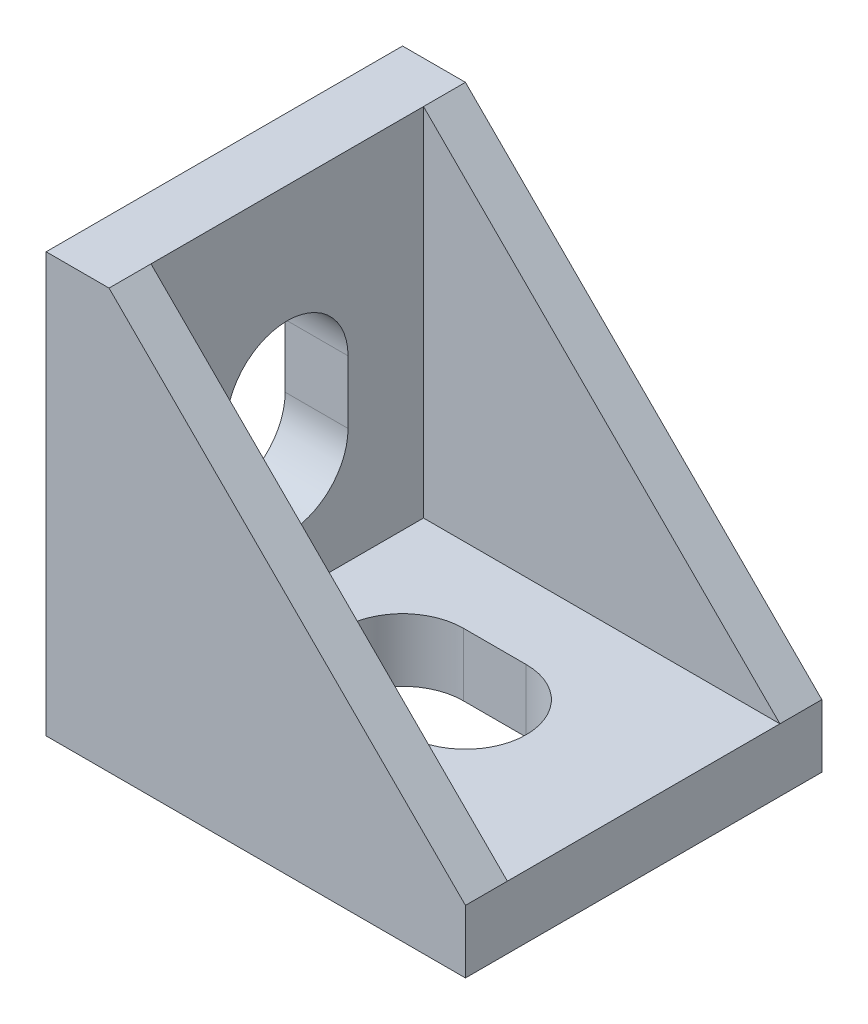
ISO-10303-21;
HEADER;
FILE_DESCRIPTION(('STEP AP214'),'2;1');
FILE_NAME('part.step','',(''),(''),'','','');
FILE_SCHEMA(('AUTOMOTIVE_DESIGN { 1 0 10303 214 1 1 1 1 }'));
ENDSEC;
DATA;
#1=APPLICATION_CONTEXT('core data for automotive mechanical design processes');
#2=APPLICATION_PROTOCOL_DEFINITION('international standard','automotive_design',2000,#1);
#3=PRODUCT_CONTEXT('',#1,'mechanical');
#4=PRODUCT('Part','Part','',(#3));
#5=PRODUCT_RELATED_PRODUCT_CATEGORY('part','',(#4));
#6=PRODUCT_DEFINITION_FORMATION('','',#4);
#7=PRODUCT_DEFINITION_CONTEXT('part definition',#1,'design');
#8=PRODUCT_DEFINITION('design','',#6,#7);
#9=PRODUCT_DEFINITION_SHAPE('','',#8);
#10=(LENGTH_UNIT() NAMED_UNIT(*) SI_UNIT(.MILLI.,.METRE.));
#11=(NAMED_UNIT(*) PLANE_ANGLE_UNIT() SI_UNIT($,.RADIAN.));
#12=(NAMED_UNIT(*) SI_UNIT($,.STERADIAN.) SOLID_ANGLE_UNIT());
#13=UNCERTAINTY_MEASURE_WITH_UNIT(LENGTH_MEASURE(1.E-05),#10,'distance_accuracy_value','');
#14=(GEOMETRIC_REPRESENTATION_CONTEXT(3) GLOBAL_UNCERTAINTY_ASSIGNED_CONTEXT((#13)) GLOBAL_UNIT_ASSIGNED_CONTEXT((#10,
#11,#12)) REPRESENTATION_CONTEXT('',''));
#15=CARTESIAN_POINT('',(0.,0.,0.));
#16=DIRECTION('',(0.,0.,1.));
#17=DIRECTION('',(1.,0.,0.));
#18=AXIS2_PLACEMENT_3D('',#15,#16,#17);
#19=CARTESIAN_POINT('',(0.,0.,8.5));
#20=DIRECTION('',(0.,1.,0.));
#21=DIRECTION('',(0.,0.,1.));
#22=AXIS2_PLACEMENT_3D('',#19,#20,#21);
#23=PLANE('',#22);
#24=DIRECTION('',(-1.,0.,0.));
#25=VECTOR('',#24,1.);
#26=CARTESIAN_POINT('',(1.5,0.,2.));
#27=LINE('',#26,#25);
#28=CARTESIAN_POINT('',(3.34999999999999,0.,2.));
#29=VERTEX_POINT('',#28);
#30=CARTESIAN_POINT('',(1.5,0.,2.));
#31=VERTEX_POINT('',#30);
#32=EDGE_CURVE('E293',#29,#31,#27,.T.);
#33=ORIENTED_EDGE('',*,*,#32,.F.);
#34=DIRECTION('',(0.,0.,-1.));
#35=VECTOR('',#34,1.);
#36=CARTESIAN_POINT('',(3.34999999999999,0.,2.));
#37=LINE('',#36,#35);
#38=CARTESIAN_POINT('',(3.34999999999999,0.,-2.));
#39=VERTEX_POINT('',#38);
#40=EDGE_CURVE('E304',#29,#39,#37,.T.);
#41=ORIENTED_EDGE('',*,*,#40,.T.);
#42=DIRECTION('',(-1.,0.,0.));
#43=VECTOR('',#42,1.);
#44=CARTESIAN_POINT('',(1.5,0.,-2.));
#45=LINE('',#44,#43);
#46=CARTESIAN_POINT('',(1.5,0.,-2.));
#47=VERTEX_POINT('',#46);
#48=EDGE_CURVE('E266',#39,#47,#45,.T.);
#49=ORIENTED_EDGE('',*,*,#48,.T.);
#50=DIRECTION('',(0.,0.,-1.));
#51=VECTOR('',#50,1.);
#52=CARTESIAN_POINT('',(1.5,0.,2.));
#53=LINE('',#52,#51);
#54=EDGE_CURVE('E60',#31,#47,#53,.T.);
#55=ORIENTED_EDGE('',*,*,#54,.F.);
#56=EDGE_LOOP('',(#33,#41,#49,#55));
#57=FACE_BOUND('',#56,.T.);
#58=DIRECTION('',(1.,0.,0.));
#59=VECTOR('',#58,1.);
#60=CARTESIAN_POINT('',(11.5,0.,2.9));
#61=LINE('',#60,#59);
#62=CARTESIAN_POINT('',(8.49999999999996,0.,2.9));
#63=VERTEX_POINT('',#62);
#64=CARTESIAN_POINT('',(11.5,0.,2.9));
#65=VERTEX_POINT('',#64);
#66=EDGE_CURVE('E404',#63,#65,#61,.T.);
#67=ORIENTED_EDGE('',*,*,#66,.T.);
#68=CARTESIAN_POINT('',(11.5,0.,0.));
#69=DIRECTION('',(0.,1.,0.));
#70=DIRECTION('',(-1.,0.,0.));
#71=AXIS2_PLACEMENT_3D('',#68,#69,#70);
#72=CIRCLE('',#71,2.9);
#73=CARTESIAN_POINT('',(11.5,0.,-2.9));
#74=VERTEX_POINT('',#73);
#75=EDGE_CURVE('E392',#65,#74,#72,.T.);
#76=ORIENTED_EDGE('',*,*,#75,.T.);
#77=DIRECTION('',(-1.,0.,0.));
#78=VECTOR('',#77,1.);
#79=CARTESIAN_POINT('',(11.5,0.,-2.9));
#80=LINE('',#79,#78);
#81=CARTESIAN_POINT('',(8.49999999999996,0.,-2.9));
#82=VERTEX_POINT('',#81);
#83=EDGE_CURVE('E395',#74,#82,#80,.T.);
#84=ORIENTED_EDGE('',*,*,#83,.T.);
#85=CARTESIAN_POINT('',(8.49999999999996,0.,0.));
#86=DIRECTION('',(0.,1.,0.));
#87=DIRECTION('',(-1.,0.,0.));
#88=AXIS2_PLACEMENT_3D('',#85,#86,#87);
#89=CIRCLE('',#88,2.9);
#90=EDGE_CURVE('E400',#82,#63,#89,.T.);
#91=ORIENTED_EDGE('',*,*,#90,.T.);
#92=EDGE_LOOP('',(#67,#76,#84,#91));
#93=FACE_BOUND('',#92,.T.);
#94=DIRECTION('',(1.,0.,0.));
#95=VECTOR('',#94,1.);
#96=CARTESIAN_POINT('',(0.,0.,-8.5));
#97=LINE('',#96,#95);
#98=CARTESIAN_POINT('',(0.,0.,-8.5));
#99=VERTEX_POINT('',#98);
#100=CARTESIAN_POINT('',(20.,0.,-8.5));
#101=VERTEX_POINT('',#100);
#102=EDGE_CURVE('E514',#99,#101,#97,.T.);
#103=ORIENTED_EDGE('',*,*,#102,.T.);
#104=DIRECTION('',(0.,0.,-1.));
#105=VECTOR('',#104,1.);
#106=CARTESIAN_POINT('',(20.,0.,8.5));
#107=LINE('',#106,#105);
#108=CARTESIAN_POINT('',(20.,0.,8.5));
#109=VERTEX_POINT('',#108);
#110=EDGE_CURVE('E530',#109,#101,#107,.T.);
#111=ORIENTED_EDGE('',*,*,#110,.F.);
#112=DIRECTION('',(1.,0.,0.));
#113=VECTOR('',#112,1.);
#114=CARTESIAN_POINT('',(0.,0.,8.5));
#115=LINE('',#114,#113);
#116=CARTESIAN_POINT('',(0.,0.,8.5));
#117=VERTEX_POINT('',#116);
#118=EDGE_CURVE('E501',#117,#109,#115,.T.);
#119=ORIENTED_EDGE('',*,*,#118,.F.);
#120=DIRECTION('',(0.,0.,-1.));
#121=VECTOR('',#120,1.);
#122=CARTESIAN_POINT('',(0.,0.,8.5));
#123=LINE('',#122,#121);
#124=EDGE_CURVE('E533',#117,#99,#123,.T.);
#125=ORIENTED_EDGE('',*,*,#124,.T.);
#126=EDGE_LOOP('',(#103,#111,#119,#125));
#127=FACE_BOUND('',#126,.T.);
#128=DIRECTION('',(-1.,0.,0.));
#129=VECTOR('',#128,1.);
#130=CARTESIAN_POINT('',(18.5,0.,2.));
#131=LINE('',#130,#129);
#132=CARTESIAN_POINT('',(18.5,0.,2.));
#133=VERTEX_POINT('',#132);
#134=CARTESIAN_POINT('',(16.65,0.,2.));
#135=VERTEX_POINT('',#134);
#136=EDGE_CURVE('E249',#133,#135,#131,.T.);
#137=ORIENTED_EDGE('',*,*,#136,.F.);
#138=DIRECTION('',(0.,0.,-1.));
#139=VECTOR('',#138,1.);
#140=CARTESIAN_POINT('',(18.5,0.,2.));
#141=LINE('',#140,#139);
#142=CARTESIAN_POINT('',(18.5,0.,-2.));
#143=VERTEX_POINT('',#142);
#144=EDGE_CURVE('E260',#133,#143,#141,.T.);
#145=ORIENTED_EDGE('',*,*,#144,.T.);
#146=DIRECTION('',(-1.,0.,0.));
#147=VECTOR('',#146,1.);
#148=CARTESIAN_POINT('',(18.5,0.,-2.));
#149=LINE('',#148,#147);
#150=CARTESIAN_POINT('',(16.65,0.,-2.));
#151=VERTEX_POINT('',#150);
#152=EDGE_CURVE('E281',#143,#151,#149,.T.);
#153=ORIENTED_EDGE('',*,*,#152,.T.);
#154=DIRECTION('',(0.,0.,-1.));
#155=VECTOR('',#154,1.);
#156=CARTESIAN_POINT('',(16.65,0.,2.));
#157=LINE('',#156,#155);
#158=EDGE_CURVE('E267',#135,#151,#157,.T.);
#159=ORIENTED_EDGE('',*,*,#158,.F.);
#160=EDGE_LOOP('',(#137,#145,#153,#159));
#161=FACE_BOUND('',#160,.T.);
#162=ADVANCED_FACE('F36',(#57,#93,#127,#161),#23,.F.);
#163=CARTESIAN_POINT('',(0.,20.,8.5));
#164=DIRECTION('',(1.,0.,0.));
#165=DIRECTION('',(0.,1.,0.));
#166=AXIS2_PLACEMENT_3D('',#163,#164,#165);
#167=PLANE('',#166);
#168=DIRECTION('',(0.,1.,0.));
#169=VECTOR('',#168,1.);
#170=CARTESIAN_POINT('',(0.,18.5,2.));
#171=LINE('',#170,#169);
#172=CARTESIAN_POINT('',(0.,16.65,2.));
#173=VERTEX_POINT('',#172);
#174=CARTESIAN_POINT('',(0.,18.5,2.));
#175=VERTEX_POINT('',#174);
#176=EDGE_CURVE('E359',#173,#175,#171,.T.);
#177=ORIENTED_EDGE('',*,*,#176,.F.);
#178=DIRECTION('',(0.,0.,-1.));
#179=VECTOR('',#178,1.);
#180=CARTESIAN_POINT('',(0.,16.65,2.));
#181=LINE('',#180,#179);
#182=CARTESIAN_POINT('',(0.,16.65,-2.));
#183=VERTEX_POINT('',#182);
#184=EDGE_CURVE('E371',#173,#183,#181,.T.);
#185=ORIENTED_EDGE('',*,*,#184,.T.);
#186=DIRECTION('',(0.,1.,0.));
#187=VECTOR('',#186,1.);
#188=CARTESIAN_POINT('',(0.,18.5,-2.));
#189=LINE('',#188,#187);
#190=CARTESIAN_POINT('',(0.,18.5,-2.));
#191=VERTEX_POINT('',#190);
#192=EDGE_CURVE('E358',#183,#191,#189,.T.);
#193=ORIENTED_EDGE('',*,*,#192,.T.);
#194=DIRECTION('',(0.,0.,-1.));
#195=VECTOR('',#194,1.);
#196=CARTESIAN_POINT('',(0.,18.5,2.));
#197=LINE('',#196,#195);
#198=EDGE_CURVE('E389',#175,#191,#197,.T.);
#199=ORIENTED_EDGE('',*,*,#198,.F.);
#200=EDGE_LOOP('',(#177,#185,#193,#199));
#201=FACE_BOUND('',#200,.T.);
#202=DIRECTION('',(0.,1.,0.));
#203=VECTOR('',#202,1.);
#204=CARTESIAN_POINT('',(0.,8.50000000000005,2.9));
#205=LINE('',#204,#203);
#206=CARTESIAN_POINT('',(0.,8.50000000000005,2.9));
#207=VERTEX_POINT('',#206);
#208=CARTESIAN_POINT('',(0.,11.5,2.9));
#209=VERTEX_POINT('',#208);
#210=EDGE_CURVE('E432',#207,#209,#205,.T.);
#211=ORIENTED_EDGE('',*,*,#210,.F.);
#212=CARTESIAN_POINT('',(0.,8.50000000000005,0.));
#213=DIRECTION('',(1.,0.,0.));
#214=DIRECTION('',(0.,1.,0.));
#215=AXIS2_PLACEMENT_3D('',#212,#213,#214);
#216=CIRCLE('',#215,2.9);
#217=CARTESIAN_POINT('',(0.,8.50000000000004,-2.9));
#218=VERTEX_POINT('',#217);
#219=EDGE_CURVE('E435',#218,#207,#216,.F.);
#220=ORIENTED_EDGE('',*,*,#219,.F.);
#221=DIRECTION('',(0.,-1.,0.));
#222=VECTOR('',#221,1.);
#223=CARTESIAN_POINT('',(0.,8.50000000000005,-2.9));
#224=LINE('',#223,#222);
#225=CARTESIAN_POINT('',(0.,11.5,-2.9));
#226=VERTEX_POINT('',#225);
#227=EDGE_CURVE('E456',#226,#218,#224,.T.);
#228=ORIENTED_EDGE('',*,*,#227,.F.);
#229=CARTESIAN_POINT('',(0.,11.5,0.));
#230=DIRECTION('',(1.,0.,0.));
#231=DIRECTION('',(0.,1.,0.));
#232=AXIS2_PLACEMENT_3D('',#229,#230,#231);
#233=CIRCLE('',#232,2.9);
#234=EDGE_CURVE('E422',#209,#226,#233,.F.);
#235=ORIENTED_EDGE('',*,*,#234,.F.);
#236=EDGE_LOOP('',(#211,#220,#228,#235));
#237=FACE_BOUND('',#236,.T.);
#238=DIRECTION('',(0.,-1.,0.));
#239=VECTOR('',#238,1.);
#240=CARTESIAN_POINT('',(0.,20.,-8.5));
#241=LINE('',#240,#239);
#242=CARTESIAN_POINT('',(0.,20.,-8.5));
#243=VERTEX_POINT('',#242);
#244=EDGE_CURVE('E511',#243,#99,#241,.T.);
#245=ORIENTED_EDGE('',*,*,#244,.T.);
#246=ORIENTED_EDGE('',*,*,#124,.F.);
#247=DIRECTION('',(0.,-1.,0.));
#248=VECTOR('',#247,1.);
#249=CARTESIAN_POINT('',(0.,20.,8.5));
#250=LINE('',#249,#248);
#251=CARTESIAN_POINT('',(0.,20.,8.5));
#252=VERTEX_POINT('',#251);
#253=EDGE_CURVE('E498',#252,#117,#250,.T.);
#254=ORIENTED_EDGE('',*,*,#253,.F.);
#255=DIRECTION('',(0.,0.,-1.));
#256=VECTOR('',#255,1.);
#257=CARTESIAN_POINT('',(0.,20.,8.5));
#258=LINE('',#257,#256);
#259=EDGE_CURVE('E537',#252,#243,#258,.T.);
#260=ORIENTED_EDGE('',*,*,#259,.T.);
#261=EDGE_LOOP('',(#245,#246,#254,#260));
#262=FACE_BOUND('',#261,.T.);
#263=DIRECTION('',(0.,1.,0.));
#264=VECTOR('',#263,1.);
#265=CARTESIAN_POINT('',(0.,1.5,2.));
#266=LINE('',#265,#264);
#267=CARTESIAN_POINT('',(0.,1.5,2.));
#268=VERTEX_POINT('',#267);
#269=CARTESIAN_POINT('',(0.,3.35,2.));
#270=VERTEX_POINT('',#269);
#271=EDGE_CURVE('E328',#268,#270,#266,.T.);
#272=ORIENTED_EDGE('',*,*,#271,.F.);
#273=DIRECTION('',(0.,0.,-1.));
#274=VECTOR('',#273,1.);
#275=CARTESIAN_POINT('',(0.,1.5,2.));
#276=LINE('',#275,#274);
#277=CARTESIAN_POINT('',(0.,1.5,-2.));
#278=VERTEX_POINT('',#277);
#279=EDGE_CURVE('E354',#268,#278,#276,.T.);
#280=ORIENTED_EDGE('',*,*,#279,.T.);
#281=DIRECTION('',(0.,1.,0.));
#282=VECTOR('',#281,1.);
#283=CARTESIAN_POINT('',(0.,1.5,-2.));
#284=LINE('',#283,#282);
#285=CARTESIAN_POINT('',(0.,3.35,-2.));
#286=VERTEX_POINT('',#285);
#287=EDGE_CURVE('E338',#278,#286,#284,.T.);
#288=ORIENTED_EDGE('',*,*,#287,.T.);
#289=DIRECTION('',(0.,0.,-1.));
#290=VECTOR('',#289,1.);
#291=CARTESIAN_POINT('',(0.,3.35,2.));
#292=LINE('',#291,#290);
#293=EDGE_CURVE('E350',#270,#286,#292,.T.);
#294=ORIENTED_EDGE('',*,*,#293,.F.);
#295=EDGE_LOOP('',(#272,#280,#288,#294));
#296=FACE_BOUND('',#295,.T.);
#297=ADVANCED_FACE('F597',(#201,#237,#262,#296),#167,.F.);
#298=CARTESIAN_POINT('',(20.,3.,8.5));
#299=DIRECTION('',(-0.707106781186547,-0.707106781186547,0.));
#300=DIRECTION('',(0.707106781186548,-0.707106781186548,0.));
#301=AXIS2_PLACEMENT_3D('',#298,#299,#300);
#302=PLANE('',#301);
#303=DIRECTION('',(0.,0.,-1.));
#304=VECTOR('',#303,1.);
#305=CARTESIAN_POINT('',(3.,20.,8.5));
#306=LINE('',#305,#304);
#307=CARTESIAN_POINT('',(3.,20.,-6.5));
#308=VERTEX_POINT('',#307);
#309=CARTESIAN_POINT('',(3.,20.,-8.5));
#310=VERTEX_POINT('',#309);
#311=EDGE_CURVE('E507',#308,#310,#306,.T.);
#312=ORIENTED_EDGE('',*,*,#311,.F.);
#313=DIRECTION('',(0.707106781186548,-0.707106781186548,0.));
#314=VECTOR('',#313,1.);
#315=CARTESIAN_POINT('',(20.,3.,-6.5));
#316=LINE('',#315,#314);
#317=CARTESIAN_POINT('',(20.,2.99999999999995,-6.5));
#318=VERTEX_POINT('',#317);
#319=EDGE_CURVE('E11',#308,#318,#316,.T.);
#320=ORIENTED_EDGE('',*,*,#319,.T.);
#321=DIRECTION('',(0.,0.,-1.));
#322=VECTOR('',#321,1.);
#323=CARTESIAN_POINT('',(20.,3.,8.5));
#324=LINE('',#323,#322);
#325=CARTESIAN_POINT('',(20.,3.,-8.5));
#326=VERTEX_POINT('',#325);
#327=EDGE_CURVE('E525',#318,#326,#324,.T.);
#328=ORIENTED_EDGE('',*,*,#327,.T.);
#329=DIRECTION('',(-0.707106781186548,0.707106781186548,0.));
#330=VECTOR('',#329,1.);
#331=CARTESIAN_POINT('',(20.,3.,-8.5));
#332=LINE('',#331,#330);
#333=EDGE_CURVE('E499',#326,#310,#332,.T.);
#334=ORIENTED_EDGE('',*,*,#333,.T.);
#335=EDGE_LOOP('',(#312,#320,#328,#334));
#336=FACE_BOUND('',#335,.T.);
#337=ADVANCED_FACE('F572',(#336),#302,.F.);
#338=CARTESIAN_POINT('',(3.,20.,8.5));
#339=DIRECTION('',(0.,-1.,0.));
#340=DIRECTION('',(1.,0.,0.));
#341=AXIS2_PLACEMENT_3D('',#338,#339,#340);
#342=PLANE('',#341);
#343=DIRECTION('',(-1.,0.,0.));
#344=VECTOR('',#343,1.);
#345=CARTESIAN_POINT('',(3.,20.,-8.5));
#346=LINE('',#345,#344);
#347=EDGE_CURVE('E491',#310,#243,#346,.T.);
#348=ORIENTED_EDGE('',*,*,#347,.T.);
#349=ORIENTED_EDGE('',*,*,#259,.F.);
#350=DIRECTION('',(-1.,0.,0.));
#351=VECTOR('',#350,1.);
#352=CARTESIAN_POINT('',(3.,20.,8.5));
#353=LINE('',#352,#351);
#354=CARTESIAN_POINT('',(3.,20.,8.5));
#355=VERTEX_POINT('',#354);
#356=EDGE_CURVE('E494',#355,#252,#353,.T.);
#357=ORIENTED_EDGE('',*,*,#356,.F.);
#358=CARTESIAN_POINT('',(3.,20.,6.5));
#359=VERTEX_POINT('',#358);
#360=EDGE_CURVE('E522',#355,#359,#306,.T.);
#361=ORIENTED_EDGE('',*,*,#360,.T.);
#362=DIRECTION('',(0.,0.,1.));
#363=VECTOR('',#362,1.);
#364=CARTESIAN_POINT('',(3.,20.,-6.5));
#365=LINE('',#364,#363);
#366=EDGE_CURVE('E469',#308,#359,#365,.T.);
#367=ORIENTED_EDGE('',*,*,#366,.F.);
#368=ORIENTED_EDGE('',*,*,#311,.T.);
#369=EDGE_LOOP('',(#348,#349,#357,#361,#367,#368));
#370=FACE_BOUND('',#369,.T.);
#371=ADVANCED_FACE('F38',(#370),#342,.F.);
#372=CARTESIAN_POINT('',(20.,0.,8.5));
#373=DIRECTION('',(-1.,0.,0.));
#374=DIRECTION('',(0.,-1.,0.));
#375=AXIS2_PLACEMENT_3D('',#372,#373,#374);
#376=PLANE('',#375);
#377=DIRECTION('',(0.,1.,0.));
#378=VECTOR('',#377,1.);
#379=CARTESIAN_POINT('',(20.,0.,-8.5));
#380=LINE('',#379,#378);
#381=EDGE_CURVE('E516',#101,#326,#380,.T.);
#382=ORIENTED_EDGE('',*,*,#381,.T.);
#383=ORIENTED_EDGE('',*,*,#327,.F.);
#384=DIRECTION('',(0.,0.,-1.));
#385=VECTOR('',#384,1.);
#386=CARTESIAN_POINT('',(20.,2.99999999999995,-6.5));
#387=LINE('',#386,#385);
#388=CARTESIAN_POINT('',(20.,2.99999999999995,6.5));
#389=VERTEX_POINT('',#388);
#390=EDGE_CURVE('E478',#389,#318,#387,.T.);
#391=ORIENTED_EDGE('',*,*,#390,.F.);
#392=CARTESIAN_POINT('',(20.,3.,8.5));
#393=VERTEX_POINT('',#392);
#394=EDGE_CURVE('E526',#393,#389,#324,.T.);
#395=ORIENTED_EDGE('',*,*,#394,.F.);
#396=DIRECTION('',(0.,1.,0.));
#397=VECTOR('',#396,1.);
#398=CARTESIAN_POINT('',(20.,0.,8.5));
#399=LINE('',#398,#397);
#400=EDGE_CURVE('E503',#109,#393,#399,.T.);
#401=ORIENTED_EDGE('',*,*,#400,.F.);
#402=ORIENTED_EDGE('',*,*,#110,.T.);
#403=EDGE_LOOP('',(#382,#383,#391,#395,#401,#402));
#404=FACE_BOUND('',#403,.T.);
#405=ADVANCED_FACE('F561',(#404),#376,.F.);
#406=ORIENTED_EDGE('',*,*,#394,.T.);
#407=DIRECTION('',(-0.707106781186548,0.707106781186548,0.));
#408=VECTOR('',#407,1.);
#409=CARTESIAN_POINT('',(20.,3.,6.5));
#410=LINE('',#409,#408);
#411=EDGE_CURVE('E45',#389,#359,#410,.T.);
#412=ORIENTED_EDGE('',*,*,#411,.T.);
#413=ORIENTED_EDGE('',*,*,#360,.F.);
#414=DIRECTION('',(-0.707106781186548,0.707106781186548,0.));
#415=VECTOR('',#414,1.);
#416=CARTESIAN_POINT('',(20.,3.,8.5));
#417=LINE('',#416,#415);
#418=EDGE_CURVE('E505',#393,#355,#417,.T.);
#419=ORIENTED_EDGE('',*,*,#418,.F.);
#420=EDGE_LOOP('',(#406,#412,#413,#419));
#421=FACE_BOUND('',#420,.T.);
#422=ADVANCED_FACE('F544',(#421),#302,.F.);
#423=CARTESIAN_POINT('',(0.,0.,8.5));
#424=DIRECTION('',(0.,0.,1.));
#425=DIRECTION('',(1.,0.,0.));
#426=AXIS2_PLACEMENT_3D('',#423,#424,#425);
#427=PLANE('',#426);
#428=ORIENTED_EDGE('',*,*,#356,.T.);
#429=ORIENTED_EDGE('',*,*,#253,.T.);
#430=ORIENTED_EDGE('',*,*,#118,.T.);
#431=ORIENTED_EDGE('',*,*,#400,.T.);
#432=ORIENTED_EDGE('',*,*,#418,.T.);
#433=EDGE_LOOP('',(#428,#429,#430,#431,#432));
#434=FACE_BOUND('',#433,.T.);
#435=ADVANCED_FACE('F554',(#434),#427,.T.);
#436=CARTESIAN_POINT('',(0.,0.,-8.5));
#437=DIRECTION('',(0.,0.,1.));
#438=DIRECTION('',(1.,0.,0.));
#439=AXIS2_PLACEMENT_3D('',#436,#437,#438);
#440=PLANE('',#439);
#441=ORIENTED_EDGE('',*,*,#347,.F.);
#442=ORIENTED_EDGE('',*,*,#333,.F.);
#443=ORIENTED_EDGE('',*,*,#381,.F.);
#444=ORIENTED_EDGE('',*,*,#102,.F.);
#445=ORIENTED_EDGE('',*,*,#244,.F.);
#446=EDGE_LOOP('',(#441,#442,#443,#444,#445));
#447=FACE_BOUND('',#446,.T.);
#448=ADVANCED_FACE('F645',(#447),#440,.F.);
#449=CARTESIAN_POINT('',(2.99999999999996,2.99999999999999,-6.5));
#450=DIRECTION('',(0.,0.,-1.));
#451=DIRECTION('',(-1.,0.,0.));
#452=AXIS2_PLACEMENT_3D('',#449,#450,#451);
#453=PLANE('',#452);
#454=DIRECTION('',(0.,1.,0.));
#455=VECTOR('',#454,1.);
#456=CARTESIAN_POINT('',(2.99999999999996,2.99999999999999,-6.5));
#457=LINE('',#456,#455);
#458=CARTESIAN_POINT('',(2.99999999999996,2.99999999999999,-6.5));
#459=VERTEX_POINT('',#458);
#460=EDGE_CURVE('E488',#459,#308,#457,.T.);
#461=ORIENTED_EDGE('',*,*,#460,.F.);
#462=DIRECTION('',(-1.,0.,0.));
#463=VECTOR('',#462,1.);
#464=CARTESIAN_POINT('',(2.99999999999996,2.99999999999999,-6.5));
#465=LINE('',#464,#463);
#466=EDGE_CURVE('E480',#318,#459,#465,.T.);
#467=ORIENTED_EDGE('',*,*,#466,.F.);
#468=ORIENTED_EDGE('',*,*,#319,.F.);
#469=EDGE_LOOP('',(#461,#467,#468));
#470=FACE_BOUND('',#469,.T.);
#471=ADVANCED_FACE('F568',(#470),#453,.F.);
#472=CARTESIAN_POINT('',(2.99999999999996,2.99999999999999,6.5));
#473=DIRECTION('',(0.,0.,1.));
#474=DIRECTION('',(1.,0.,0.));
#475=AXIS2_PLACEMENT_3D('',#472,#473,#474);
#476=PLANE('',#475);
#477=DIRECTION('',(1.,0.,0.));
#478=VECTOR('',#477,1.);
#479=CARTESIAN_POINT('',(2.99999999999996,2.99999999999999,6.5));
#480=LINE('',#479,#478);
#481=CARTESIAN_POINT('',(2.99999999999996,2.99999999999999,6.5));
#482=VERTEX_POINT('',#481);
#483=EDGE_CURVE('E474',#482,#389,#480,.T.);
#484=ORIENTED_EDGE('',*,*,#483,.F.);
#485=DIRECTION('',(0.,1.,0.));
#486=VECTOR('',#485,1.);
#487=CARTESIAN_POINT('',(2.99999999999996,2.99999999999999,6.5));
#488=LINE('',#487,#486);
#489=EDGE_CURVE('E484',#482,#359,#488,.T.);
#490=ORIENTED_EDGE('',*,*,#489,.T.);
#491=ORIENTED_EDGE('',*,*,#411,.F.);
#492=EDGE_LOOP('',(#484,#490,#491));
#493=FACE_BOUND('',#492,.T.);
#494=ADVANCED_FACE('F659',(#493),#476,.F.);
#495=CARTESIAN_POINT('',(2.99999999999996,2.99999999999999,-6.5));
#496=DIRECTION('',(-1.,0.,0.));
#497=DIRECTION('',(0.,-1.,0.));
#498=AXIS2_PLACEMENT_3D('',#495,#496,#497);
#499=PLANE('',#498);
#500=DIRECTION('',(0.,1.,0.));
#501=VECTOR('',#500,1.);
#502=CARTESIAN_POINT('',(2.99999999999998,8.50000000000004,-2.9));
#503=LINE('',#502,#501);
#504=CARTESIAN_POINT('',(2.99999999999998,8.50000000000004,-2.9));
#505=VERTEX_POINT('',#504);
#506=CARTESIAN_POINT('',(2.99999999999998,11.5,-2.9));
#507=VERTEX_POINT('',#506);
#508=EDGE_CURVE('E441',#505,#507,#503,.T.);
#509=ORIENTED_EDGE('',*,*,#508,.F.);
#510=CARTESIAN_POINT('',(2.99999999999998,8.50000000000004,0.));
#511=DIRECTION('',(1.,0.,0.));
#512=DIRECTION('',(0.,1.,0.));
#513=AXIS2_PLACEMENT_3D('',#510,#511,#512);
#514=CIRCLE('',#513,2.9);
#515=CARTESIAN_POINT('',(2.99999999999998,8.50000000000004,2.9));
#516=VERTEX_POINT('',#515);
#517=EDGE_CURVE('E439',#516,#505,#514,.T.);
#518=ORIENTED_EDGE('',*,*,#517,.F.);
#519=DIRECTION('',(0.,-1.,0.));
#520=VECTOR('',#519,1.);
#521=CARTESIAN_POINT('',(2.99999999999998,8.50000000000004,2.9));
#522=LINE('',#521,#520);
#523=CARTESIAN_POINT('',(2.99999999999998,11.5,2.9));
#524=VERTEX_POINT('',#523);
#525=EDGE_CURVE('E448',#524,#516,#522,.T.);
#526=ORIENTED_EDGE('',*,*,#525,.F.);
#527=CARTESIAN_POINT('',(2.99999999999998,11.5,0.));
#528=DIRECTION('',(1.,0.,0.));
#529=DIRECTION('',(0.,1.,0.));
#530=AXIS2_PLACEMENT_3D('',#527,#528,#529);
#531=CIRCLE('',#530,2.9);
#532=EDGE_CURVE('E444',#507,#524,#531,.T.);
#533=ORIENTED_EDGE('',*,*,#532,.F.);
#534=EDGE_LOOP('',(#509,#518,#526,#533));
#535=FACE_BOUND('',#534,.T.);
#536=ORIENTED_EDGE('',*,*,#366,.T.);
#537=ORIENTED_EDGE('',*,*,#489,.F.);
#538=DIRECTION('',(0.,0.,1.));
#539=VECTOR('',#538,1.);
#540=CARTESIAN_POINT('',(2.99999999999996,2.99999999999999,-6.5));
#541=LINE('',#540,#539);
#542=EDGE_CURVE('E470',#459,#482,#541,.T.);
#543=ORIENTED_EDGE('',*,*,#542,.F.);
#544=ORIENTED_EDGE('',*,*,#460,.T.);
#545=EDGE_LOOP('',(#536,#537,#543,#544));
#546=FACE_BOUND('',#545,.T.);
#547=ADVANCED_FACE('F666',(#535,#546),#499,.F.);
#548=CARTESIAN_POINT('',(0.,3.,0.));
#549=DIRECTION('',(0.,1.,0.));
#550=DIRECTION('',(-1.,0.,0.));
#551=AXIS2_PLACEMENT_3D('',#548,#549,#550);
#552=PLANE('',#551);
#553=CARTESIAN_POINT('',(11.5,2.99999999999997,0.));
#554=DIRECTION('',(0.,1.,0.));
#555=DIRECTION('',(-1.,0.,0.));
#556=AXIS2_PLACEMENT_3D('',#553,#554,#555);
#557=CIRCLE('',#556,2.9);
#558=CARTESIAN_POINT('',(11.5,2.99999999999997,2.9));
#559=VERTEX_POINT('',#558);
#560=CARTESIAN_POINT('',(11.5,2.99999999999997,-2.9));
#561=VERTEX_POINT('',#560);
#562=EDGE_CURVE('E391',#559,#561,#557,.T.);
#563=ORIENTED_EDGE('',*,*,#562,.F.);
#564=DIRECTION('',(1.,0.,0.));
#565=VECTOR('',#564,1.);
#566=CARTESIAN_POINT('',(11.5,2.99999999999997,2.9));
#567=LINE('',#566,#565);
#568=CARTESIAN_POINT('',(8.49999999999997,2.99999999999998,2.9));
#569=VERTEX_POINT('',#568);
#570=EDGE_CURVE('E396',#569,#559,#567,.T.);
#571=ORIENTED_EDGE('',*,*,#570,.F.);
#572=CARTESIAN_POINT('',(8.49999999999997,2.99999999999998,0.));
#573=DIRECTION('',(0.,1.,0.));
#574=DIRECTION('',(-1.,0.,0.));
#575=AXIS2_PLACEMENT_3D('',#572,#573,#574);
#576=CIRCLE('',#575,2.9);
#577=CARTESIAN_POINT('',(8.49999999999997,2.99999999999998,-2.9));
#578=VERTEX_POINT('',#577);
#579=EDGE_CURVE('E413',#578,#569,#576,.T.);
#580=ORIENTED_EDGE('',*,*,#579,.F.);
#581=DIRECTION('',(-1.,0.,0.));
#582=VECTOR('',#581,1.);
#583=CARTESIAN_POINT('',(11.5,2.99999999999997,-2.9));
#584=LINE('',#583,#582);
#585=EDGE_CURVE('E409',#561,#578,#584,.T.);
#586=ORIENTED_EDGE('',*,*,#585,.F.);
#587=EDGE_LOOP('',(#563,#571,#580,#586));
#588=FACE_BOUND('',#587,.T.);
#589=ORIENTED_EDGE('',*,*,#542,.T.);
#590=ORIENTED_EDGE('',*,*,#483,.T.);
#591=ORIENTED_EDGE('',*,*,#390,.T.);
#592=ORIENTED_EDGE('',*,*,#466,.T.);
#593=EDGE_LOOP('',(#589,#590,#591,#592));
#594=FACE_BOUND('',#593,.T.);
#595=ADVANCED_FACE('F565',(#588,#594),#552,.T.);
#596=CARTESIAN_POINT('',(-0.00100000000002789,8.50000000000005,0.));
#597=DIRECTION('',(1.,0.,0.));
#598=DIRECTION('',(0.,1.,0.));
#599=AXIS2_PLACEMENT_3D('',#596,#597,#598);
#600=CYLINDRICAL_SURFACE('',#599,2.9);
#601=ORIENTED_EDGE('',*,*,#219,.T.);
#602=DIRECTION('',(1.,0.,0.));
#603=VECTOR('',#602,1.);
#604=CARTESIAN_POINT('',(-0.00100000000002745,8.50000000000005,2.9));
#605=LINE('',#604,#603);
#606=EDGE_CURVE('E453',#207,#516,#605,.T.);
#607=ORIENTED_EDGE('',*,*,#606,.T.);
#608=ORIENTED_EDGE('',*,*,#517,.T.);
#609=DIRECTION('',(1.,0.,0.));
#610=VECTOR('',#609,1.);
#611=CARTESIAN_POINT('',(-0.00100000000002832,8.50000000000005,-2.9));
#612=LINE('',#611,#610);
#613=EDGE_CURVE('E452',#218,#505,#612,.T.);
#614=ORIENTED_EDGE('',*,*,#613,.F.);
#615=EDGE_LOOP('',(#601,#607,#608,#614));
#616=FACE_BOUND('',#615,.T.);
#617=ADVANCED_FACE('F680',(#616),#600,.F.);
#618=CARTESIAN_POINT('',(-0.00100000000002745,8.50000000000005,2.9));
#619=DIRECTION('',(0.,0.,1.));
#620=DIRECTION('',(0.,-1.,0.));
#621=AXIS2_PLACEMENT_3D('',#618,#619,#620);
#622=PLANE('',#621);
#623=ORIENTED_EDGE('',*,*,#210,.T.);
#624=DIRECTION('',(1.,0.,0.));
#625=VECTOR('',#624,1.);
#626=CARTESIAN_POINT('',(-0.00100000000002052,11.5,2.9));
#627=LINE('',#626,#625);
#628=EDGE_CURVE('E457',#209,#524,#627,.T.);
#629=ORIENTED_EDGE('',*,*,#628,.T.);
#630=ORIENTED_EDGE('',*,*,#525,.T.);
#631=ORIENTED_EDGE('',*,*,#606,.F.);
#632=EDGE_LOOP('',(#623,#629,#630,#631));
#633=FACE_BOUND('',#632,.T.);
#634=ADVANCED_FACE('F688',(#633),#622,.F.);
#635=CARTESIAN_POINT('',(-0.00100000000002095,11.5,0.));
#636=DIRECTION('',(1.,0.,0.));
#637=DIRECTION('',(0.,1.,0.));
#638=AXIS2_PLACEMENT_3D('',#635,#636,#637);
#639=CYLINDRICAL_SURFACE('',#638,2.9);
#640=ORIENTED_EDGE('',*,*,#234,.T.);
#641=DIRECTION('',(1.,0.,0.));
#642=VECTOR('',#641,1.);
#643=CARTESIAN_POINT('',(-0.00100000000002138,11.5,-2.9));
#644=LINE('',#643,#642);
#645=EDGE_CURVE('E460',#226,#507,#644,.T.);
#646=ORIENTED_EDGE('',*,*,#645,.T.);
#647=ORIENTED_EDGE('',*,*,#532,.T.);
#648=ORIENTED_EDGE('',*,*,#628,.F.);
#649=EDGE_LOOP('',(#640,#646,#647,#648));
#650=FACE_BOUND('',#649,.T.);
#651=ADVANCED_FACE('F696',(#650),#639,.F.);
#652=CARTESIAN_POINT('',(-0.00100000000002832,8.50000000000005,-2.9));
#653=DIRECTION('',(0.,0.,-1.));
#654=DIRECTION('',(0.,1.,0.));
#655=AXIS2_PLACEMENT_3D('',#652,#653,#654);
#656=PLANE('',#655);
#657=ORIENTED_EDGE('',*,*,#227,.T.);
#658=ORIENTED_EDGE('',*,*,#613,.T.);
#659=ORIENTED_EDGE('',*,*,#508,.T.);
#660=ORIENTED_EDGE('',*,*,#645,.F.);
#661=EDGE_LOOP('',(#657,#658,#659,#660));
#662=FACE_BOUND('',#661,.T.);
#663=ADVANCED_FACE('F705',(#662),#656,.F.);
#664=CARTESIAN_POINT('',(11.5,0.,0.));
#665=DIRECTION('',(0.,1.,0.));
#666=DIRECTION('',(-1.,0.,0.));
#667=AXIS2_PLACEMENT_3D('',#664,#665,#666);
#668=CYLINDRICAL_SURFACE('',#667,2.9);
#669=ORIENTED_EDGE('',*,*,#562,.T.);
#670=DIRECTION('',(0.,1.,0.));
#671=VECTOR('',#670,1.);
#672=CARTESIAN_POINT('',(11.5,0.,-2.9));
#673=LINE('',#672,#671);
#674=EDGE_CURVE('E407',#74,#561,#673,.T.);
#675=ORIENTED_EDGE('',*,*,#674,.F.);
#676=ORIENTED_EDGE('',*,*,#75,.F.);
#677=DIRECTION('',(0.,1.,0.));
#678=VECTOR('',#677,1.);
#679=CARTESIAN_POINT('',(11.5,0.,2.9));
#680=LINE('',#679,#678);
#681=EDGE_CURVE('E419',#65,#559,#680,.T.);
#682=ORIENTED_EDGE('',*,*,#681,.T.);
#683=EDGE_LOOP('',(#669,#675,#676,#682));
#684=FACE_BOUND('',#683,.T.);
#685=ADVANCED_FACE('F712',(#684),#668,.F.);
#686=CARTESIAN_POINT('',(11.5,0.,2.9));
#687=DIRECTION('',(0.,0.,1.));
#688=DIRECTION('',(1.,0.,0.));
#689=AXIS2_PLACEMENT_3D('',#686,#687,#688);
#690=PLANE('',#689);
#691=ORIENTED_EDGE('',*,*,#570,.T.);
#692=ORIENTED_EDGE('',*,*,#681,.F.);
#693=ORIENTED_EDGE('',*,*,#66,.F.);
#694=DIRECTION('',(0.,1.,0.));
#695=VECTOR('',#694,1.);
#696=CARTESIAN_POINT('',(8.49999999999996,0.,2.9));
#697=LINE('',#696,#695);
#698=EDGE_CURVE('E423',#63,#569,#697,.T.);
#699=ORIENTED_EDGE('',*,*,#698,.T.);
#700=EDGE_LOOP('',(#691,#692,#693,#699));
#701=FACE_BOUND('',#700,.T.);
#702=ADVANCED_FACE('F720',(#701),#690,.F.);
#703=CARTESIAN_POINT('',(8.49999999999996,0.,0.));
#704=DIRECTION('',(0.,1.,0.));
#705=DIRECTION('',(-1.,0.,0.));
#706=AXIS2_PLACEMENT_3D('',#703,#704,#705);
#707=CYLINDRICAL_SURFACE('',#706,2.9);
#708=ORIENTED_EDGE('',*,*,#579,.T.);
#709=ORIENTED_EDGE('',*,*,#698,.F.);
#710=ORIENTED_EDGE('',*,*,#90,.F.);
#711=DIRECTION('',(0.,1.,0.));
#712=VECTOR('',#711,1.);
#713=CARTESIAN_POINT('',(8.49999999999996,0.,-2.9));
#714=LINE('',#713,#712);
#715=EDGE_CURVE('E426',#82,#578,#714,.T.);
#716=ORIENTED_EDGE('',*,*,#715,.T.);
#717=EDGE_LOOP('',(#708,#709,#710,#716));
#718=FACE_BOUND('',#717,.T.);
#719=ADVANCED_FACE('F728',(#718),#707,.F.);
#720=CARTESIAN_POINT('',(11.5,0.,-2.9));
#721=DIRECTION('',(0.,0.,-1.));
#722=DIRECTION('',(-1.,0.,0.));
#723=AXIS2_PLACEMENT_3D('',#720,#721,#722);
#724=PLANE('',#723);
#725=ORIENTED_EDGE('',*,*,#585,.T.);
#726=ORIENTED_EDGE('',*,*,#715,.F.);
#727=ORIENTED_EDGE('',*,*,#83,.F.);
#728=ORIENTED_EDGE('',*,*,#674,.T.);
#729=EDGE_LOOP('',(#725,#726,#727,#728));
#730=FACE_BOUND('',#729,.T.);
#731=ADVANCED_FACE('F736',(#730),#724,.F.);
#732=CARTESIAN_POINT('',(0.,18.5,2.));
#733=DIRECTION('',(0.,-1.,0.));
#734=DIRECTION('',(1.,0.,0.));
#735=AXIS2_PLACEMENT_3D('',#732,#733,#734);
#736=PLANE('',#735);
#737=DIRECTION('',(-1.,0.,0.));
#738=VECTOR('',#737,1.);
#739=CARTESIAN_POINT('',(0.,18.5,-2.));
#740=LINE('',#739,#738);
#741=CARTESIAN_POINT('',(-1.,18.5,-2.));
#742=VERTEX_POINT('',#741);
#743=EDGE_CURVE('E374',#191,#742,#740,.T.);
#744=ORIENTED_EDGE('',*,*,#743,.T.);
#745=DIRECTION('',(0.,0.,-1.));
#746=VECTOR('',#745,1.);
#747=CARTESIAN_POINT('',(-1.,18.5,2.));
#748=LINE('',#747,#746);
#749=CARTESIAN_POINT('',(-1.,18.5,2.));
#750=VERTEX_POINT('',#749);
#751=EDGE_CURVE('E385',#750,#742,#748,.T.);
#752=ORIENTED_EDGE('',*,*,#751,.F.);
#753=DIRECTION('',(-1.,0.,0.));
#754=VECTOR('',#753,1.);
#755=CARTESIAN_POINT('',(0.,18.5,2.));
#756=LINE('',#755,#754);
#757=EDGE_CURVE('E362',#175,#750,#756,.T.);
#758=ORIENTED_EDGE('',*,*,#757,.F.);
#759=ORIENTED_EDGE('',*,*,#198,.T.);
#760=EDGE_LOOP('',(#744,#752,#758,#759));
#761=FACE_BOUND('',#760,.T.);
#762=ADVANCED_FACE('F743',(#761),#736,.F.);
#763=CARTESIAN_POINT('',(-1.,18.5,2.));
#764=DIRECTION('',(1.,0.,0.));
#765=DIRECTION('',(0.,1.,0.));
#766=AXIS2_PLACEMENT_3D('',#763,#764,#765);
#767=PLANE('',#766);
#768=DIRECTION('',(0.,-1.,0.));
#769=VECTOR('',#768,1.);
#770=CARTESIAN_POINT('',(-1.,18.5,-2.));
#771=LINE('',#770,#769);
#772=CARTESIAN_POINT('',(-1.,16.65,-2.));
#773=VERTEX_POINT('',#772);
#774=EDGE_CURVE('E376',#742,#773,#771,.T.);
#775=ORIENTED_EDGE('',*,*,#774,.T.);
#776=DIRECTION('',(0.,0.,-1.));
#777=VECTOR('',#776,1.);
#778=CARTESIAN_POINT('',(-1.,16.65,2.));
#779=LINE('',#778,#777);
#780=CARTESIAN_POINT('',(-1.,16.65,2.));
#781=VERTEX_POINT('',#780);
#782=EDGE_CURVE('E381',#781,#773,#779,.T.);
#783=ORIENTED_EDGE('',*,*,#782,.F.);
#784=DIRECTION('',(0.,-1.,0.));
#785=VECTOR('',#784,1.);
#786=CARTESIAN_POINT('',(-1.,18.5,2.));
#787=LINE('',#786,#785);
#788=EDGE_CURVE('E365',#750,#781,#787,.T.);
#789=ORIENTED_EDGE('',*,*,#788,.F.);
#790=ORIENTED_EDGE('',*,*,#751,.T.);
#791=EDGE_LOOP('',(#775,#783,#789,#790));
#792=FACE_BOUND('',#791,.T.);
#793=ADVANCED_FACE('F750',(#792),#767,.F.);
#794=CARTESIAN_POINT('',(0.,16.65,2.));
#795=DIRECTION('',(0.,1.,0.));
#796=DIRECTION('',(0.,0.,1.));
#797=AXIS2_PLACEMENT_3D('',#794,#795,#796);
#798=PLANE('',#797);
#799=DIRECTION('',(1.,0.,0.));
#800=VECTOR('',#799,1.);
#801=CARTESIAN_POINT('',(0.,16.65,-2.));
#802=LINE('',#801,#800);
#803=EDGE_CURVE('E363',#773,#183,#802,.T.);
#804=ORIENTED_EDGE('',*,*,#803,.T.);
#805=ORIENTED_EDGE('',*,*,#184,.F.);
#806=DIRECTION('',(1.,0.,0.));
#807=VECTOR('',#806,1.);
#808=CARTESIAN_POINT('',(0.,16.65,2.));
#809=LINE('',#808,#807);
#810=EDGE_CURVE('E368',#781,#173,#809,.T.);
#811=ORIENTED_EDGE('',*,*,#810,.F.);
#812=ORIENTED_EDGE('',*,*,#782,.T.);
#813=EDGE_LOOP('',(#804,#805,#811,#812));
#814=FACE_BOUND('',#813,.T.);
#815=ADVANCED_FACE('F758',(#814),#798,.F.);
#816=CARTESIAN_POINT('',(0.,0.,2.));
#817=DIRECTION('',(0.,0.,-1.));
#818=DIRECTION('',(-1.,0.,0.));
#819=AXIS2_PLACEMENT_3D('',#816,#817,#818);
#820=PLANE('',#819);
#821=ORIENTED_EDGE('',*,*,#176,.T.);
#822=ORIENTED_EDGE('',*,*,#757,.T.);
#823=ORIENTED_EDGE('',*,*,#788,.T.);
#824=ORIENTED_EDGE('',*,*,#810,.T.);
#825=EDGE_LOOP('',(#821,#822,#823,#824));
#826=FACE_BOUND('',#825,.T.);
#827=ADVANCED_FACE('F766',(#826),#820,.F.);
#828=CARTESIAN_POINT('',(0.,0.,-2.));
#829=DIRECTION('',(0.,0.,-1.));
#830=DIRECTION('',(-1.,0.,0.));
#831=AXIS2_PLACEMENT_3D('',#828,#829,#830);
#832=PLANE('',#831);
#833=ORIENTED_EDGE('',*,*,#192,.F.);
#834=ORIENTED_EDGE('',*,*,#803,.F.);
#835=ORIENTED_EDGE('',*,*,#774,.F.);
#836=ORIENTED_EDGE('',*,*,#743,.F.);
#837=EDGE_LOOP('',(#833,#834,#835,#836));
#838=FACE_BOUND('',#837,.T.);
#839=ADVANCED_FACE('F774',(#838),#832,.T.);
#840=CARTESIAN_POINT('',(0.,1.5,2.));
#841=DIRECTION('',(0.,1.,0.));
#842=DIRECTION('',(-1.,0.,0.));
#843=AXIS2_PLACEMENT_3D('',#840,#841,#842);
#844=PLANE('',#843);
#845=DIRECTION('',(1.,0.,0.));
#846=VECTOR('',#845,1.);
#847=CARTESIAN_POINT('',(0.,1.5,-2.));
#848=LINE('',#847,#846);
#849=CARTESIAN_POINT('',(-0.999999999999998,1.49999999999999,-2.));
#850=VERTEX_POINT('',#849);
#851=EDGE_CURVE('E325',#850,#278,#848,.T.);
#852=ORIENTED_EDGE('',*,*,#851,.T.);
#853=ORIENTED_EDGE('',*,*,#279,.F.);
#854=DIRECTION('',(1.,0.,0.));
#855=VECTOR('',#854,1.);
#856=CARTESIAN_POINT('',(0.,1.5,2.));
#857=LINE('',#856,#855);
#858=CARTESIAN_POINT('',(-0.999999999999998,1.49999999999999,2.));
#859=VERTEX_POINT('',#858);
#860=EDGE_CURVE('E326',#859,#268,#857,.T.);
#861=ORIENTED_EDGE('',*,*,#860,.F.);
#862=DIRECTION('',(0.,0.,-1.));
#863=VECTOR('',#862,1.);
#864=CARTESIAN_POINT('',(-0.999999999999998,1.49999999999999,2.));
#865=LINE('',#864,#863);
#866=EDGE_CURVE('E335',#859,#850,#865,.T.);
#867=ORIENTED_EDGE('',*,*,#866,.T.);
#868=EDGE_LOOP('',(#852,#853,#861,#867));
#869=FACE_BOUND('',#868,.T.);
#870=ADVANCED_FACE('F782',(#869),#844,.F.);
#871=CARTESIAN_POINT('',(0.,3.35,2.));
#872=DIRECTION('',(0.,-1.,0.));
#873=DIRECTION('',(0.,0.,-1.));
#874=AXIS2_PLACEMENT_3D('',#871,#872,#873);
#875=PLANE('',#874);
#876=DIRECTION('',(-1.,0.,0.));
#877=VECTOR('',#876,1.);
#878=CARTESIAN_POINT('',(0.,3.35,-2.));
#879=LINE('',#878,#877);
#880=CARTESIAN_POINT('',(-0.999999999999998,3.35,-2.));
#881=VERTEX_POINT('',#880);
#882=EDGE_CURVE('E341',#286,#881,#879,.T.);
#883=ORIENTED_EDGE('',*,*,#882,.T.);
#884=DIRECTION('',(0.,0.,-1.));
#885=VECTOR('',#884,1.);
#886=CARTESIAN_POINT('',(-0.999999999999998,3.35,2.));
#887=LINE('',#886,#885);
#888=CARTESIAN_POINT('',(-0.999999999999998,3.35,2.));
#889=VERTEX_POINT('',#888);
#890=EDGE_CURVE('E346',#889,#881,#887,.T.);
#891=ORIENTED_EDGE('',*,*,#890,.F.);
#892=DIRECTION('',(-1.,0.,0.));
#893=VECTOR('',#892,1.);
#894=CARTESIAN_POINT('',(0.,3.35,2.));
#895=LINE('',#894,#893);
#896=EDGE_CURVE('E331',#270,#889,#895,.T.);
#897=ORIENTED_EDGE('',*,*,#896,.F.);
#898=ORIENTED_EDGE('',*,*,#293,.T.);
#899=EDGE_LOOP('',(#883,#891,#897,#898));
#900=FACE_BOUND('',#899,.T.);
#901=ADVANCED_FACE('F790',(#900),#875,.F.);
#902=CARTESIAN_POINT('',(-0.999999999999998,1.49999999999999,2.));
#903=DIRECTION('',(1.,0.,0.));
#904=DIRECTION('',(0.,1.,0.));
#905=AXIS2_PLACEMENT_3D('',#902,#903,#904);
#906=PLANE('',#905);
#907=DIRECTION('',(0.,-1.,0.));
#908=VECTOR('',#907,1.);
#909=CARTESIAN_POINT('',(-0.999999999999998,1.49999999999999,-2.));
#910=LINE('',#909,#908);
#911=EDGE_CURVE('E329',#881,#850,#910,.T.);
#912=ORIENTED_EDGE('',*,*,#911,.T.);
#913=ORIENTED_EDGE('',*,*,#866,.F.);
#914=DIRECTION('',(0.,-1.,0.));
#915=VECTOR('',#914,1.);
#916=CARTESIAN_POINT('',(-0.999999999999998,1.49999999999999,2.));
#917=LINE('',#916,#915);
#918=EDGE_CURVE('E333',#889,#859,#917,.T.);
#919=ORIENTED_EDGE('',*,*,#918,.F.);
#920=ORIENTED_EDGE('',*,*,#890,.T.);
#921=EDGE_LOOP('',(#912,#913,#919,#920));
#922=FACE_BOUND('',#921,.T.);
#923=ADVANCED_FACE('F798',(#922),#906,.F.);
#924=CARTESIAN_POINT('',(0.,0.,2.));
#925=DIRECTION('',(0.,0.,-1.));
#926=DIRECTION('',(-1.,0.,0.));
#927=AXIS2_PLACEMENT_3D('',#924,#925,#926);
#928=PLANE('',#927);
#929=ORIENTED_EDGE('',*,*,#860,.T.);
#930=ORIENTED_EDGE('',*,*,#271,.T.);
#931=ORIENTED_EDGE('',*,*,#896,.T.);
#932=ORIENTED_EDGE('',*,*,#918,.T.);
#933=EDGE_LOOP('',(#929,#930,#931,#932));
#934=FACE_BOUND('',#933,.T.);
#935=ADVANCED_FACE('F806',(#934),#928,.F.);
#936=CARTESIAN_POINT('',(0.,0.,-2.));
#937=DIRECTION('',(0.,0.,-1.));
#938=DIRECTION('',(-1.,0.,0.));
#939=AXIS2_PLACEMENT_3D('',#936,#937,#938);
#940=PLANE('',#939);
#941=ORIENTED_EDGE('',*,*,#851,.F.);
#942=ORIENTED_EDGE('',*,*,#911,.F.);
#943=ORIENTED_EDGE('',*,*,#882,.F.);
#944=ORIENTED_EDGE('',*,*,#287,.F.);
#945=EDGE_LOOP('',(#941,#942,#943,#944));
#946=FACE_BOUND('',#945,.T.);
#947=ADVANCED_FACE('F814',(#946),#940,.T.);
#948=CARTESIAN_POINT('',(1.5,0.,2.));
#949=DIRECTION('',(1.,0.,0.));
#950=DIRECTION('',(0.,1.,0.));
#951=AXIS2_PLACEMENT_3D('',#948,#949,#950);
#952=PLANE('',#951);
#953=DIRECTION('',(0.,-1.,0.));
#954=VECTOR('',#953,1.);
#955=CARTESIAN_POINT('',(1.5,0.,-2.));
#956=LINE('',#955,#954);
#957=CARTESIAN_POINT('',(1.5,-0.999999999999991,-2.));
#958=VERTEX_POINT('',#957);
#959=EDGE_CURVE('E307',#47,#958,#956,.T.);
#960=ORIENTED_EDGE('',*,*,#959,.T.);
#961=DIRECTION('',(0.,0.,-1.));
#962=VECTOR('',#961,1.);
#963=CARTESIAN_POINT('',(1.5,-0.999999999999991,2.));
#964=LINE('',#963,#962);
#965=CARTESIAN_POINT('',(1.5,-0.999999999999991,2.));
#966=VERTEX_POINT('',#965);
#967=EDGE_CURVE('E321',#966,#958,#964,.T.);
#968=ORIENTED_EDGE('',*,*,#967,.F.);
#969=DIRECTION('',(0.,-1.,0.));
#970=VECTOR('',#969,1.);
#971=CARTESIAN_POINT('',(1.5,0.,2.));
#972=LINE('',#971,#970);
#973=EDGE_CURVE('E296',#31,#966,#972,.T.);
#974=ORIENTED_EDGE('',*,*,#973,.F.);
#975=ORIENTED_EDGE('',*,*,#54,.T.);
#976=EDGE_LOOP('',(#960,#968,#974,#975));
#977=FACE_BOUND('',#976,.T.);
#978=ADVANCED_FACE('F822',(#977),#952,.F.);
#979=CARTESIAN_POINT('',(1.5,-0.999999999999991,2.));
#980=DIRECTION('',(0.,1.,0.));
#981=DIRECTION('',(-1.,0.,0.));
#982=AXIS2_PLACEMENT_3D('',#979,#980,#981);
#983=PLANE('',#982);
#984=DIRECTION('',(1.,0.,0.));
#985=VECTOR('',#984,1.);
#986=CARTESIAN_POINT('',(1.5,-0.999999999999991,-2.));
#987=LINE('',#986,#985);
#988=CARTESIAN_POINT('',(3.35,-0.999999999999984,-2.));
#989=VERTEX_POINT('',#988);
#990=EDGE_CURVE('E309',#958,#989,#987,.T.);
#991=ORIENTED_EDGE('',*,*,#990,.T.);
#992=DIRECTION('',(0.,0.,-1.));
#993=VECTOR('',#992,1.);
#994=CARTESIAN_POINT('',(3.35,-0.999999999999984,2.));
#995=LINE('',#994,#993);
#996=CARTESIAN_POINT('',(3.35,-0.999999999999984,2.));
#997=VERTEX_POINT('',#996);
#998=EDGE_CURVE('E317',#997,#989,#995,.T.);
#999=ORIENTED_EDGE('',*,*,#998,.F.);
#1000=DIRECTION('',(1.,0.,0.));
#1001=VECTOR('',#1000,1.);
#1002=CARTESIAN_POINT('',(1.5,-0.999999999999991,2.));
#1003=LINE('',#1002,#1001);
#1004=EDGE_CURVE('E299',#966,#997,#1003,.T.);
#1005=ORIENTED_EDGE('',*,*,#1004,.F.);
#1006=ORIENTED_EDGE('',*,*,#967,.T.);
#1007=EDGE_LOOP('',(#991,#999,#1005,#1006));
#1008=FACE_BOUND('',#1007,.T.);
#1009=ADVANCED_FACE('F830',(#1008),#983,.F.);
#1010=CARTESIAN_POINT('',(3.34999999999999,0.,2.));
#1011=DIRECTION('',(-1.,0.,0.));
#1012=DIRECTION('',(0.,-1.,0.));
#1013=AXIS2_PLACEMENT_3D('',#1010,#1011,#1012);
#1014=PLANE('',#1013);
#1015=DIRECTION('',(0.,1.,0.));
#1016=VECTOR('',#1015,1.);
#1017=CARTESIAN_POINT('',(3.34999999999999,0.,-2.));
#1018=LINE('',#1017,#1016);
#1019=EDGE_CURVE('E297',#989,#39,#1018,.T.);
#1020=ORIENTED_EDGE('',*,*,#1019,.T.);
#1021=ORIENTED_EDGE('',*,*,#40,.F.);
#1022=DIRECTION('',(0.,1.,0.));
#1023=VECTOR('',#1022,1.);
#1024=CARTESIAN_POINT('',(3.34999999999999,0.,2.));
#1025=LINE('',#1024,#1023);
#1026=EDGE_CURVE('E302',#997,#29,#1025,.T.);
#1027=ORIENTED_EDGE('',*,*,#1026,.F.);
#1028=ORIENTED_EDGE('',*,*,#998,.T.);
#1029=EDGE_LOOP('',(#1020,#1021,#1027,#1028));
#1030=FACE_BOUND('',#1029,.T.);
#1031=ADVANCED_FACE('F837',(#1030),#1014,.F.);
#1032=CARTESIAN_POINT('',(0.,0.,2.));
#1033=DIRECTION('',(0.,0.,-1.));
#1034=DIRECTION('',(-1.,0.,0.));
#1035=AXIS2_PLACEMENT_3D('',#1032,#1033,#1034);
#1036=PLANE('',#1035);
#1037=ORIENTED_EDGE('',*,*,#32,.T.);
#1038=ORIENTED_EDGE('',*,*,#973,.T.);
#1039=ORIENTED_EDGE('',*,*,#1004,.T.);
#1040=ORIENTED_EDGE('',*,*,#1026,.T.);
#1041=EDGE_LOOP('',(#1037,#1038,#1039,#1040));
#1042=FACE_BOUND('',#1041,.T.);
#1043=ADVANCED_FACE('F845',(#1042),#1036,.F.);
#1044=CARTESIAN_POINT('',(0.,0.,-2.));
#1045=DIRECTION('',(0.,0.,-1.));
#1046=DIRECTION('',(-1.,0.,0.));
#1047=AXIS2_PLACEMENT_3D('',#1044,#1045,#1046);
#1048=PLANE('',#1047);
#1049=ORIENTED_EDGE('',*,*,#48,.F.);
#1050=ORIENTED_EDGE('',*,*,#1019,.F.);
#1051=ORIENTED_EDGE('',*,*,#990,.F.);
#1052=ORIENTED_EDGE('',*,*,#959,.F.);
#1053=EDGE_LOOP('',(#1049,#1050,#1051,#1052));
#1054=FACE_BOUND('',#1053,.T.);
#1055=ADVANCED_FACE('F853',(#1054),#1048,.T.);
#1056=CARTESIAN_POINT('',(18.5,0.,2.));
#1057=DIRECTION('',(-1.,0.,0.));
#1058=DIRECTION('',(0.,-1.,0.));
#1059=AXIS2_PLACEMENT_3D('',#1056,#1057,#1058);
#1060=PLANE('',#1059);
#1061=DIRECTION('',(0.,1.,0.));
#1062=VECTOR('',#1061,1.);
#1063=CARTESIAN_POINT('',(18.5,0.,-2.));
#1064=LINE('',#1063,#1062);
#1065=CARTESIAN_POINT('',(18.5,-0.999999999999928,-2.));
#1066=VERTEX_POINT('',#1065);
#1067=EDGE_CURVE('E263',#1066,#143,#1064,.T.);
#1068=ORIENTED_EDGE('',*,*,#1067,.T.);
#1069=ORIENTED_EDGE('',*,*,#144,.F.);
#1070=DIRECTION('',(0.,1.,0.));
#1071=VECTOR('',#1070,1.);
#1072=CARTESIAN_POINT('',(18.5,0.,2.));
#1073=LINE('',#1072,#1071);
#1074=CARTESIAN_POINT('',(18.5,-0.999999999999928,2.));
#1075=VERTEX_POINT('',#1074);
#1076=EDGE_CURVE('E245',#1075,#133,#1073,.T.);
#1077=ORIENTED_EDGE('',*,*,#1076,.F.);
#1078=DIRECTION('',(0.,0.,-1.));
#1079=VECTOR('',#1078,1.);
#1080=CARTESIAN_POINT('',(18.5,-0.999999999999928,2.));
#1081=LINE('',#1080,#1079);
#1082=EDGE_CURVE('E279',#1075,#1066,#1081,.T.);
#1083=ORIENTED_EDGE('',*,*,#1082,.T.);
#1084=EDGE_LOOP('',(#1068,#1069,#1077,#1083));
#1085=FACE_BOUND('',#1084,.T.);
#1086=ADVANCED_FACE('F261',(#1085),#1060,.F.);
#1087=CARTESIAN_POINT('',(16.65,0.,2.));
#1088=DIRECTION('',(1.,0.,0.));
#1089=DIRECTION('',(0.,1.,0.));
#1090=AXIS2_PLACEMENT_3D('',#1087,#1088,#1089);
#1091=PLANE('',#1090);
#1092=DIRECTION('',(0.,-1.,0.));
#1093=VECTOR('',#1092,1.);
#1094=CARTESIAN_POINT('',(16.65,0.,-2.));
#1095=LINE('',#1094,#1093);
#1096=CARTESIAN_POINT('',(16.65,-0.999999999999935,-2.));
#1097=VERTEX_POINT('',#1096);
#1098=EDGE_CURVE('E52',#151,#1097,#1095,.T.);
#1099=ORIENTED_EDGE('',*,*,#1098,.T.);
#1100=DIRECTION('',(0.,0.,-1.));
#1101=VECTOR('',#1100,1.);
#1102=CARTESIAN_POINT('',(16.65,-0.999999999999935,2.));
#1103=LINE('',#1102,#1101);
#1104=CARTESIAN_POINT('',(16.65,-0.999999999999935,2.));
#1105=VERTEX_POINT('',#1104);
#1106=EDGE_CURVE('E287',#1105,#1097,#1103,.T.);
#1107=ORIENTED_EDGE('',*,*,#1106,.F.);
#1108=DIRECTION('',(0.,-1.,0.));
#1109=VECTOR('',#1108,1.);
#1110=CARTESIAN_POINT('',(16.65,0.,2.));
#1111=LINE('',#1110,#1109);
#1112=EDGE_CURVE('E271',#135,#1105,#1111,.T.);
#1113=ORIENTED_EDGE('',*,*,#1112,.F.);
#1114=ORIENTED_EDGE('',*,*,#158,.T.);
#1115=EDGE_LOOP('',(#1099,#1107,#1113,#1114));
#1116=FACE_BOUND('',#1115,.T.);
#1117=ADVANCED_FACE('F868',(#1116),#1091,.F.);
#1118=CARTESIAN_POINT('',(18.5,-0.999999999999928,2.));
#1119=DIRECTION('',(0.,1.,0.));
#1120=DIRECTION('',(-1.,0.,0.));
#1121=AXIS2_PLACEMENT_3D('',#1118,#1119,#1120);
#1122=PLANE('',#1121);
#1123=DIRECTION('',(1.,0.,0.));
#1124=VECTOR('',#1123,1.);
#1125=CARTESIAN_POINT('',(18.5,-0.999999999999928,-2.));
#1126=LINE('',#1125,#1124);
#1127=EDGE_CURVE('E256',#1097,#1066,#1126,.T.);
#1128=ORIENTED_EDGE('',*,*,#1127,.T.);
#1129=ORIENTED_EDGE('',*,*,#1082,.F.);
#1130=DIRECTION('',(1.,0.,0.));
#1131=VECTOR('',#1130,1.);
#1132=CARTESIAN_POINT('',(18.5,-0.999999999999928,2.));
#1133=LINE('',#1132,#1131);
#1134=EDGE_CURVE('E252',#1105,#1075,#1133,.T.);
#1135=ORIENTED_EDGE('',*,*,#1134,.F.);
#1136=ORIENTED_EDGE('',*,*,#1106,.T.);
#1137=EDGE_LOOP('',(#1128,#1129,#1135,#1136));
#1138=FACE_BOUND('',#1137,.T.);
#1139=ADVANCED_FACE('F875',(#1138),#1122,.F.);
#1140=CARTESIAN_POINT('',(0.,0.,2.));
#1141=DIRECTION('',(0.,0.,-1.));
#1142=DIRECTION('',(-1.,0.,0.));
#1143=AXIS2_PLACEMENT_3D('',#1140,#1141,#1142);
#1144=PLANE('',#1143);
#1145=ORIENTED_EDGE('',*,*,#1076,.T.);
#1146=ORIENTED_EDGE('',*,*,#136,.T.);
#1147=ORIENTED_EDGE('',*,*,#1112,.T.);
#1148=ORIENTED_EDGE('',*,*,#1134,.T.);
#1149=EDGE_LOOP('',(#1145,#1146,#1147,#1148));
#1150=FACE_BOUND('',#1149,.T.);
#1151=ADVANCED_FACE('F247',(#1150),#1144,.F.);
#1152=CARTESIAN_POINT('',(0.,0.,-2.));
#1153=DIRECTION('',(0.,0.,-1.));
#1154=DIRECTION('',(-1.,0.,0.));
#1155=AXIS2_PLACEMENT_3D('',#1152,#1153,#1154);
#1156=PLANE('',#1155);
#1157=ORIENTED_EDGE('',*,*,#1067,.F.);
#1158=ORIENTED_EDGE('',*,*,#1127,.F.);
#1159=ORIENTED_EDGE('',*,*,#1098,.F.);
#1160=ORIENTED_EDGE('',*,*,#152,.F.);
#1161=EDGE_LOOP('',(#1157,#1158,#1159,#1160));
#1162=FACE_BOUND('',#1161,.T.);
#1163=ADVANCED_FACE('F890',(#1162),#1156,.T.);
#1164=CLOSED_SHELL('',(#162,#297,#337,#371,#405,#422,#435,#448,#471,#494,#547,#595,#617,#634,
#651,#663,#685,#702,#719,#731,#762,#793,#815,#827,#839,#870,#901,#923,#935,#947,#978,#1009,
#1031,#1043,#1055,#1086,#1117,#1139,#1151,#1163));
#1165=MANIFOLD_SOLID_BREP('B2',#1164);
#1166=ADVANCED_BREP_SHAPE_REPRESENTATION('',(#18,#1165),#14);
#1167=SHAPE_DEFINITION_REPRESENTATION(#9,#1166);
ENDSEC;
END-ISO-10303-21;
